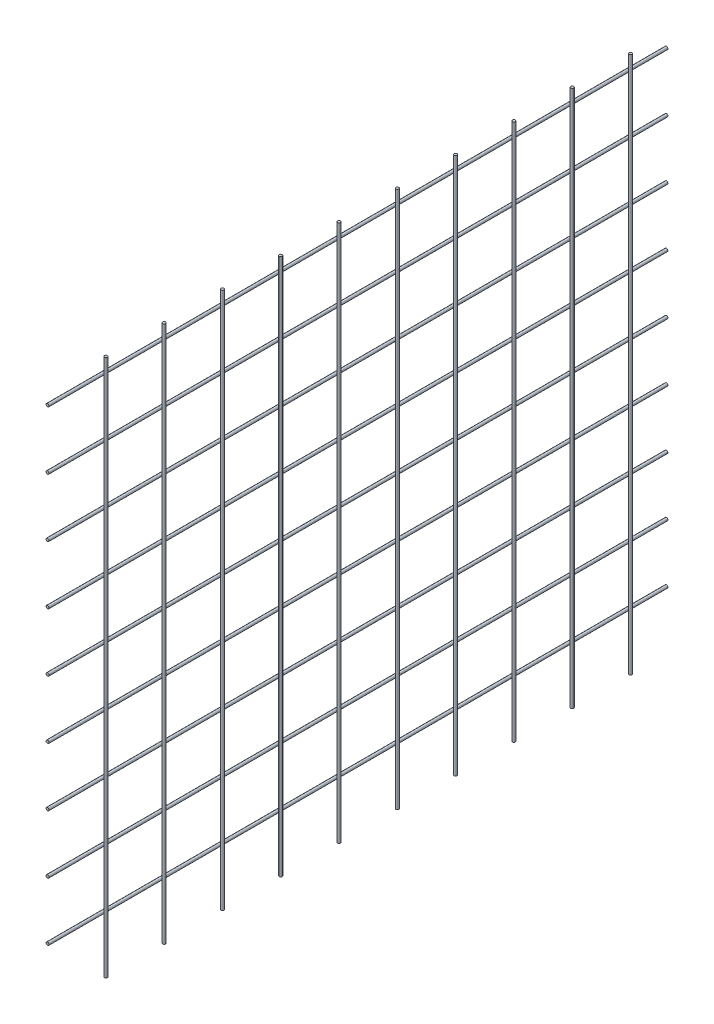
ISO-10303-21;
HEADER;
FILE_DESCRIPTION(('STEP AP214'),'2;1');
FILE_NAME('part.step','',(''),(''),'','','');
FILE_SCHEMA(('AUTOMOTIVE_DESIGN { 1 0 10303 214 1 1 1 1 }'));
ENDSEC;
DATA;
#1=APPLICATION_CONTEXT('core data for automotive mechanical design processes');
#2=APPLICATION_PROTOCOL_DEFINITION('international standard','automotive_design',2000,#1);
#3=PRODUCT_CONTEXT('',#1,'mechanical');
#4=PRODUCT('Part','Part','',(#3));
#5=PRODUCT_RELATED_PRODUCT_CATEGORY('part','',(#4));
#6=PRODUCT_DEFINITION_FORMATION('','',#4);
#7=PRODUCT_DEFINITION_CONTEXT('part definition',#1,'design');
#8=PRODUCT_DEFINITION('design','',#6,#7);
#9=PRODUCT_DEFINITION_SHAPE('','',#8);
#10=(LENGTH_UNIT() NAMED_UNIT(*) SI_UNIT(.MILLI.,.METRE.));
#11=(NAMED_UNIT(*) PLANE_ANGLE_UNIT() SI_UNIT($,.RADIAN.));
#12=(NAMED_UNIT(*) SI_UNIT($,.STERADIAN.) SOLID_ANGLE_UNIT());
#13=UNCERTAINTY_MEASURE_WITH_UNIT(LENGTH_MEASURE(1.E-05),#10,'distance_accuracy_value','');
#14=(GEOMETRIC_REPRESENTATION_CONTEXT(3) GLOBAL_UNCERTAINTY_ASSIGNED_CONTEXT((#13)) GLOBAL_UNIT_ASSIGNED_CONTEXT((#10,
#11,#12)) REPRESENTATION_CONTEXT('',''));
#15=CARTESIAN_POINT('',(0.,0.,0.));
#16=DIRECTION('',(0.,0.,1.));
#17=DIRECTION('',(1.,0.,0.));
#18=AXIS2_PLACEMENT_3D('',#15,#16,#17);
#19=CARTESIAN_POINT('',(0.,760.,-3080.002));
#20=DIRECTION('',(0.,0.,1.));
#21=DIRECTION('',(1.,0.,0.));
#22=AXIS2_PLACEMENT_3D('',#19,#20,#21);
#23=CYLINDRICAL_SURFACE('',#22,1.49999999999986);
#24=CARTESIAN_POINT('',(0.,760.,-3040.));
#25=DIRECTION('',(0.,0.,-1.));
#26=DIRECTION('',(-1.,0.,0.));
#27=AXIS2_PLACEMENT_3D('',#24,#25,#26);
#28=CIRCLE('',#27,1.49999999999986);
#29=CARTESIAN_POINT('',(-1.49999999999985,760.,-3040.));
#30=VERTEX_POINT('',#29);
#31=EDGE_CURVE('E11',#30,#30,#28,.T.);
#32=ORIENTED_EDGE('',*,*,#31,.F.);
#33=EDGE_LOOP('',(#32));
#34=FACE_BOUND('',#33,.T.);
#35=CARTESIAN_POINT('',(0.,760.,-2403.00000000001));
#36=DIRECTION('',(0.,0.,1.));
#37=DIRECTION('',(1.,0.,0.));
#38=AXIS2_PLACEMENT_3D('',#35,#36,#37);
#39=CIRCLE('',#38,1.49999999999986);
#40=CARTESIAN_POINT('',(1.49999999999988,760.,-2403.00000000001));
#41=VERTEX_POINT('',#40);
#42=EDGE_CURVE('E55',#41,#41,#39,.T.);
#43=ORIENTED_EDGE('',*,*,#42,.F.);
#44=EDGE_LOOP('',(#43));
#45=FACE_BOUND('',#44,.T.);
#46=ADVANCED_FACE('F52',(#34,#45),#23,.T.);
#47=CARTESIAN_POINT('',(-15.4999999999997,-2.22044604925031E-13,-3040.));
#48=DIRECTION('',(0.,0.,-1.));
#49=DIRECTION('',(-1.,0.,0.));
#50=AXIS2_PLACEMENT_3D('',#47,#48,#49);
#51=PLANE('',#50);
#52=ORIENTED_EDGE('',*,*,#31,.T.);
#53=EDGE_LOOP('',(#52));
#54=FACE_BOUND('',#53,.T.);
#55=ADVANCED_FACE('F71',(#54),#51,.T.);
#56=CARTESIAN_POINT('',(-20.01,1256.5,-2403.));
#57=DIRECTION('',(0.,0.,1.));
#58=DIRECTION('',(1.,0.,0.));
#59=AXIS2_PLACEMENT_3D('',#56,#57,#58);
#60=PLANE('',#59);
#61=ORIENTED_EDGE('',*,*,#42,.T.);
#62=EDGE_LOOP('',(#61));
#63=FACE_BOUND('',#62,.T.);
#64=ADVANCED_FACE('F68',(#63),#60,.T.);
#65=CLOSED_SHELL('',(#46,#55,#64));
#66=MANIFOLD_SOLID_BREP('B2',#65);
#67=CARTESIAN_POINT('',(0.,820.,-3080.002));
#68=DIRECTION('',(0.,0.,1.));
#69=DIRECTION('',(1.,0.,0.));
#70=AXIS2_PLACEMENT_3D('',#67,#68,#69);
#71=CYLINDRICAL_SURFACE('',#70,1.49999999999986);
#72=CARTESIAN_POINT('',(0.,820.,-3040.));
#73=DIRECTION('',(0.,0.,-1.));
#74=DIRECTION('',(-1.,0.,0.));
#75=AXIS2_PLACEMENT_3D('',#72,#73,#74);
#76=CIRCLE('',#75,1.49999999999986);
#77=CARTESIAN_POINT('',(-1.49999999999985,820.,-3040.));
#78=VERTEX_POINT('',#77);
#79=EDGE_CURVE('E51',#78,#78,#76,.T.);
#80=ORIENTED_EDGE('',*,*,#79,.F.);
#81=EDGE_LOOP('',(#80));
#82=FACE_BOUND('',#81,.T.);
#83=CARTESIAN_POINT('',(0.,820.,-2403.00000000001));
#84=DIRECTION('',(0.,0.,1.));
#85=DIRECTION('',(1.,0.,0.));
#86=AXIS2_PLACEMENT_3D('',#83,#84,#85);
#87=CIRCLE('',#86,1.49999999999986);
#88=CARTESIAN_POINT('',(1.49999999999988,820.,-2403.00000000001));
#89=VERTEX_POINT('',#88);
#90=EDGE_CURVE('E102',#89,#89,#87,.T.);
#91=ORIENTED_EDGE('',*,*,#90,.F.);
#92=EDGE_LOOP('',(#91));
#93=FACE_BOUND('',#92,.T.);
#94=ADVANCED_FACE('F99',(#82,#93),#71,.T.);
#95=CARTESIAN_POINT('',(-15.4999999999997,-2.22044604925031E-13,-3040.));
#96=DIRECTION('',(0.,0.,-1.));
#97=DIRECTION('',(-1.,0.,0.));
#98=AXIS2_PLACEMENT_3D('',#95,#96,#97);
#99=PLANE('',#98);
#100=ORIENTED_EDGE('',*,*,#79,.T.);
#101=EDGE_LOOP('',(#100));
#102=FACE_BOUND('',#101,.T.);
#103=ADVANCED_FACE('F118',(#102),#99,.T.);
#104=CARTESIAN_POINT('',(-20.01,1256.5,-2403.));
#105=DIRECTION('',(0.,0.,1.));
#106=DIRECTION('',(1.,0.,0.));
#107=AXIS2_PLACEMENT_3D('',#104,#105,#106);
#108=PLANE('',#107);
#109=ORIENTED_EDGE('',*,*,#90,.T.);
#110=EDGE_LOOP('',(#109));
#111=FACE_BOUND('',#110,.T.);
#112=ADVANCED_FACE('F115',(#111),#108,.T.);
#113=CLOSED_SHELL('',(#94,#103,#112));
#114=MANIFOLD_SOLID_BREP('B6',#113);
#115=CARTESIAN_POINT('',(0.,880.,-3080.002));
#116=DIRECTION('',(0.,0.,1.));
#117=DIRECTION('',(1.,0.,0.));
#118=AXIS2_PLACEMENT_3D('',#115,#116,#117);
#119=CYLINDRICAL_SURFACE('',#118,1.49999999999986);
#120=CARTESIAN_POINT('',(0.,880.,-3040.));
#121=DIRECTION('',(0.,0.,-1.));
#122=DIRECTION('',(-1.,0.,0.));
#123=AXIS2_PLACEMENT_3D('',#120,#121,#122);
#124=CIRCLE('',#123,1.49999999999986);
#125=CARTESIAN_POINT('',(-1.49999999999985,880.,-3040.));
#126=VERTEX_POINT('',#125);
#127=EDGE_CURVE('E98',#126,#126,#124,.T.);
#128=ORIENTED_EDGE('',*,*,#127,.F.);
#129=EDGE_LOOP('',(#128));
#130=FACE_BOUND('',#129,.T.);
#131=CARTESIAN_POINT('',(0.,880.,-2403.00000000001));
#132=DIRECTION('',(0.,0.,1.));
#133=DIRECTION('',(1.,0.,0.));
#134=AXIS2_PLACEMENT_3D('',#131,#132,#133);
#135=CIRCLE('',#134,1.49999999999986);
#136=CARTESIAN_POINT('',(1.49999999999988,880.,-2403.00000000001));
#137=VERTEX_POINT('',#136);
#138=EDGE_CURVE('E149',#137,#137,#135,.T.);
#139=ORIENTED_EDGE('',*,*,#138,.F.);
#140=EDGE_LOOP('',(#139));
#141=FACE_BOUND('',#140,.T.);
#142=ADVANCED_FACE('F146',(#130,#141),#119,.T.);
#143=CARTESIAN_POINT('',(-15.4999999999997,-2.22044604925031E-13,-3040.));
#144=DIRECTION('',(0.,0.,-1.));
#145=DIRECTION('',(-1.,0.,0.));
#146=AXIS2_PLACEMENT_3D('',#143,#144,#145);
#147=PLANE('',#146);
#148=ORIENTED_EDGE('',*,*,#127,.T.);
#149=EDGE_LOOP('',(#148));
#150=FACE_BOUND('',#149,.T.);
#151=ADVANCED_FACE('F166',(#150),#147,.T.);
#152=CARTESIAN_POINT('',(-20.01,1256.5,-2403.));
#153=DIRECTION('',(0.,0.,1.));
#154=DIRECTION('',(1.,0.,0.));
#155=AXIS2_PLACEMENT_3D('',#152,#153,#154);
#156=PLANE('',#155);
#157=ORIENTED_EDGE('',*,*,#138,.T.);
#158=EDGE_LOOP('',(#157));
#159=FACE_BOUND('',#158,.T.);
#160=ADVANCED_FACE('F163',(#159),#156,.T.);
#161=CLOSED_SHELL('',(#142,#151,#160));
#162=MANIFOLD_SOLID_BREP('B46',#161);
#163=CARTESIAN_POINT('',(0.,940.,-3080.002));
#164=DIRECTION('',(0.,0.,1.));
#165=DIRECTION('',(1.,0.,0.));
#166=AXIS2_PLACEMENT_3D('',#163,#164,#165);
#167=CYLINDRICAL_SURFACE('',#166,1.49999999999986);
#168=CARTESIAN_POINT('',(0.,940.,-3040.));
#169=DIRECTION('',(0.,0.,-1.));
#170=DIRECTION('',(-1.,0.,0.));
#171=AXIS2_PLACEMENT_3D('',#168,#169,#170);
#172=CIRCLE('',#171,1.49999999999986);
#173=CARTESIAN_POINT('',(-1.49999999999985,940.,-3040.));
#174=VERTEX_POINT('',#173);
#175=EDGE_CURVE('E145',#174,#174,#172,.T.);
#176=ORIENTED_EDGE('',*,*,#175,.F.);
#177=EDGE_LOOP('',(#176));
#178=FACE_BOUND('',#177,.T.);
#179=CARTESIAN_POINT('',(0.,940.,-2403.00000000001));
#180=DIRECTION('',(0.,0.,1.));
#181=DIRECTION('',(1.,0.,0.));
#182=AXIS2_PLACEMENT_3D('',#179,#180,#181);
#183=CIRCLE('',#182,1.49999999999986);
#184=CARTESIAN_POINT('',(1.49999999999988,940.,-2403.00000000001));
#185=VERTEX_POINT('',#184);
#186=EDGE_CURVE('E197',#185,#185,#183,.T.);
#187=ORIENTED_EDGE('',*,*,#186,.F.);
#188=EDGE_LOOP('',(#187));
#189=FACE_BOUND('',#188,.T.);
#190=ADVANCED_FACE('F194',(#178,#189),#167,.T.);
#191=CARTESIAN_POINT('',(-15.4999999999997,-2.22044604925031E-13,-3040.));
#192=DIRECTION('',(0.,0.,-1.));
#193=DIRECTION('',(-1.,0.,0.));
#194=AXIS2_PLACEMENT_3D('',#191,#192,#193);
#195=PLANE('',#194);
#196=ORIENTED_EDGE('',*,*,#175,.T.);
#197=EDGE_LOOP('',(#196));
#198=FACE_BOUND('',#197,.T.);
#199=ADVANCED_FACE('F214',(#198),#195,.T.);
#200=CARTESIAN_POINT('',(-20.01,1256.5,-2403.));
#201=DIRECTION('',(0.,0.,1.));
#202=DIRECTION('',(1.,0.,0.));
#203=AXIS2_PLACEMENT_3D('',#200,#201,#202);
#204=PLANE('',#203);
#205=ORIENTED_EDGE('',*,*,#186,.T.);
#206=EDGE_LOOP('',(#205));
#207=FACE_BOUND('',#206,.T.);
#208=ADVANCED_FACE('F211',(#207),#204,.T.);
#209=CLOSED_SHELL('',(#190,#199,#208));
#210=MANIFOLD_SOLID_BREP('B93',#209);
#211=CARTESIAN_POINT('',(0.,1000.,-3080.002));
#212=DIRECTION('',(0.,0.,1.));
#213=DIRECTION('',(1.,0.,0.));
#214=AXIS2_PLACEMENT_3D('',#211,#212,#213);
#215=CYLINDRICAL_SURFACE('',#214,1.49999999999986);
#216=CARTESIAN_POINT('',(0.,1000.,-3040.));
#217=DIRECTION('',(0.,0.,-1.));
#218=DIRECTION('',(-1.,0.,0.));
#219=AXIS2_PLACEMENT_3D('',#216,#217,#218);
#220=CIRCLE('',#219,1.49999999999986);
#221=CARTESIAN_POINT('',(-1.49999999999986,1000.,-3040.));
#222=VERTEX_POINT('',#221);
#223=EDGE_CURVE('E193',#222,#222,#220,.T.);
#224=ORIENTED_EDGE('',*,*,#223,.F.);
#225=EDGE_LOOP('',(#224));
#226=FACE_BOUND('',#225,.T.);
#227=CARTESIAN_POINT('',(0.,1000.,-2403.00000000001));
#228=DIRECTION('',(0.,0.,1.));
#229=DIRECTION('',(1.,0.,0.));
#230=AXIS2_PLACEMENT_3D('',#227,#228,#229);
#231=CIRCLE('',#230,1.49999999999986);
#232=CARTESIAN_POINT('',(1.49999999999986,1000.,-2403.00000000001));
#233=VERTEX_POINT('',#232);
#234=EDGE_CURVE('E245',#233,#233,#231,.T.);
#235=ORIENTED_EDGE('',*,*,#234,.F.);
#236=EDGE_LOOP('',(#235));
#237=FACE_BOUND('',#236,.T.);
#238=ADVANCED_FACE('F242',(#226,#237),#215,.T.);
#239=CARTESIAN_POINT('',(-15.4999999999997,-2.22044604925031E-13,-3040.));
#240=DIRECTION('',(0.,0.,-1.));
#241=DIRECTION('',(-1.,0.,0.));
#242=AXIS2_PLACEMENT_3D('',#239,#240,#241);
#243=PLANE('',#242);
#244=ORIENTED_EDGE('',*,*,#223,.T.);
#245=EDGE_LOOP('',(#244));
#246=FACE_BOUND('',#245,.T.);
#247=ADVANCED_FACE('F262',(#246),#243,.T.);
#248=CARTESIAN_POINT('',(-20.01,1256.5,-2403.));
#249=DIRECTION('',(0.,0.,1.));
#250=DIRECTION('',(1.,0.,0.));
#251=AXIS2_PLACEMENT_3D('',#248,#249,#250);
#252=PLANE('',#251);
#253=ORIENTED_EDGE('',*,*,#234,.T.);
#254=EDGE_LOOP('',(#253));
#255=FACE_BOUND('',#254,.T.);
#256=ADVANCED_FACE('F259',(#255),#252,.T.);
#257=CLOSED_SHELL('',(#238,#247,#256));
#258=MANIFOLD_SOLID_BREP('B140',#257);
#259=CARTESIAN_POINT('',(0.,1060.,-3080.002));
#260=DIRECTION('',(0.,0.,1.));
#261=DIRECTION('',(1.,0.,0.));
#262=AXIS2_PLACEMENT_3D('',#259,#260,#261);
#263=CYLINDRICAL_SURFACE('',#262,1.49999999999986);
#264=CARTESIAN_POINT('',(-5.32907051820075E-12,1060.00000000001,-3040.));
#265=DIRECTION('',(0.,0.,-1.));
#266=DIRECTION('',(-1.,0.,0.));
#267=AXIS2_PLACEMENT_3D('',#264,#265,#266);
#268=CIRCLE('',#267,1.49999999999986);
#269=CARTESIAN_POINT('',(-1.50000000000519,1060.00000000001,-3040.));
#270=VERTEX_POINT('',#269);
#271=EDGE_CURVE('E241',#270,#270,#268,.T.);
#272=ORIENTED_EDGE('',*,*,#271,.F.);
#273=EDGE_LOOP('',(#272));
#274=FACE_BOUND('',#273,.T.);
#275=CARTESIAN_POINT('',(-5.32907051820075E-12,1060.,-2403.00000000001));
#276=DIRECTION('',(0.,0.,1.));
#277=DIRECTION('',(1.,0.,0.));
#278=AXIS2_PLACEMENT_3D('',#275,#276,#277);
#279=CIRCLE('',#278,1.49999999999986);
#280=CARTESIAN_POINT('',(1.49999999999454,1060.,-2403.00000000001));
#281=VERTEX_POINT('',#280);
#282=EDGE_CURVE('E293',#281,#281,#279,.T.);
#283=ORIENTED_EDGE('',*,*,#282,.F.);
#284=EDGE_LOOP('',(#283));
#285=FACE_BOUND('',#284,.T.);
#286=ADVANCED_FACE('F290',(#274,#285),#263,.T.);
#287=CARTESIAN_POINT('',(-15.4999999999997,-2.22044604925031E-13,-3040.));
#288=DIRECTION('',(0.,0.,-1.));
#289=DIRECTION('',(-1.,0.,0.));
#290=AXIS2_PLACEMENT_3D('',#287,#288,#289);
#291=PLANE('',#290);
#292=ORIENTED_EDGE('',*,*,#271,.T.);
#293=EDGE_LOOP('',(#292));
#294=FACE_BOUND('',#293,.T.);
#295=ADVANCED_FACE('F310',(#294),#291,.T.);
#296=CARTESIAN_POINT('',(-20.01,1256.5,-2403.));
#297=DIRECTION('',(0.,0.,1.));
#298=DIRECTION('',(1.,0.,0.));
#299=AXIS2_PLACEMENT_3D('',#296,#297,#298);
#300=PLANE('',#299);
#301=ORIENTED_EDGE('',*,*,#282,.T.);
#302=EDGE_LOOP('',(#301));
#303=FACE_BOUND('',#302,.T.);
#304=ADVANCED_FACE('F307',(#303),#300,.T.);
#305=CLOSED_SHELL('',(#286,#295,#304));
#306=MANIFOLD_SOLID_BREP('B188',#305);
#307=CARTESIAN_POINT('',(0.,1120.,-3080.002));
#308=DIRECTION('',(0.,0.,1.));
#309=DIRECTION('',(1.,0.,0.));
#310=AXIS2_PLACEMENT_3D('',#307,#308,#309);
#311=CYLINDRICAL_SURFACE('',#310,1.49999999999986);
#312=CARTESIAN_POINT('',(0.,1120.,-3040.));
#313=DIRECTION('',(0.,0.,-1.));
#314=DIRECTION('',(-1.,0.,0.));
#315=AXIS2_PLACEMENT_3D('',#312,#313,#314);
#316=CIRCLE('',#315,1.49999999999986);
#317=CARTESIAN_POINT('',(-1.49999999999986,1120.,-3040.));
#318=VERTEX_POINT('',#317);
#319=EDGE_CURVE('E289',#318,#318,#316,.T.);
#320=ORIENTED_EDGE('',*,*,#319,.F.);
#321=EDGE_LOOP('',(#320));
#322=FACE_BOUND('',#321,.T.);
#323=CARTESIAN_POINT('',(0.,1120.,-2403.00000000001));
#324=DIRECTION('',(0.,0.,1.));
#325=DIRECTION('',(1.,0.,0.));
#326=AXIS2_PLACEMENT_3D('',#323,#324,#325);
#327=CIRCLE('',#326,1.49999999999986);
#328=CARTESIAN_POINT('',(1.49999999999986,1120.,-2403.00000000001));
#329=VERTEX_POINT('',#328);
#330=EDGE_CURVE('E341',#329,#329,#327,.T.);
#331=ORIENTED_EDGE('',*,*,#330,.F.);
#332=EDGE_LOOP('',(#331));
#333=FACE_BOUND('',#332,.T.);
#334=ADVANCED_FACE('F338',(#322,#333),#311,.T.);
#335=CARTESIAN_POINT('',(-15.4999999999997,-2.22044604925031E-13,-3040.));
#336=DIRECTION('',(0.,0.,-1.));
#337=DIRECTION('',(-1.,0.,0.));
#338=AXIS2_PLACEMENT_3D('',#335,#336,#337);
#339=PLANE('',#338);
#340=ORIENTED_EDGE('',*,*,#319,.T.);
#341=EDGE_LOOP('',(#340));
#342=FACE_BOUND('',#341,.T.);
#343=ADVANCED_FACE('F358',(#342),#339,.T.);
#344=CARTESIAN_POINT('',(-20.01,1256.5,-2403.));
#345=DIRECTION('',(0.,0.,1.));
#346=DIRECTION('',(1.,0.,0.));
#347=AXIS2_PLACEMENT_3D('',#344,#345,#346);
#348=PLANE('',#347);
#349=ORIENTED_EDGE('',*,*,#330,.T.);
#350=EDGE_LOOP('',(#349));
#351=FACE_BOUND('',#350,.T.);
#352=ADVANCED_FACE('F355',(#351),#348,.T.);
#353=CLOSED_SHELL('',(#334,#343,#352));
#354=MANIFOLD_SOLID_BREP('B236',#353);
#355=CARTESIAN_POINT('',(0.,1180.,-3080.002));
#356=DIRECTION('',(0.,0.,1.));
#357=DIRECTION('',(1.,0.,0.));
#358=AXIS2_PLACEMENT_3D('',#355,#356,#357);
#359=CYLINDRICAL_SURFACE('',#358,1.49999999999986);
#360=CARTESIAN_POINT('',(-5.32907051820075E-12,1180.,-3040.));
#361=DIRECTION('',(0.,0.,-1.));
#362=DIRECTION('',(-1.,0.,0.));
#363=AXIS2_PLACEMENT_3D('',#360,#361,#362);
#364=CIRCLE('',#363,1.49999999999986);
#365=CARTESIAN_POINT('',(-1.50000000000519,1180.,-3040.));
#366=VERTEX_POINT('',#365);
#367=EDGE_CURVE('E337',#366,#366,#364,.T.);
#368=ORIENTED_EDGE('',*,*,#367,.F.);
#369=EDGE_LOOP('',(#368));
#370=FACE_BOUND('',#369,.T.);
#371=CARTESIAN_POINT('',(-5.32907051820075E-12,1180.,-2403.00000000001));
#372=DIRECTION('',(0.,0.,1.));
#373=DIRECTION('',(1.,0.,0.));
#374=AXIS2_PLACEMENT_3D('',#371,#372,#373);
#375=CIRCLE('',#374,1.49999999999986);
#376=CARTESIAN_POINT('',(1.49999999999454,1180.,-2403.00000000001));
#377=VERTEX_POINT('',#376);
#378=EDGE_CURVE('E389',#377,#377,#375,.T.);
#379=ORIENTED_EDGE('',*,*,#378,.F.);
#380=EDGE_LOOP('',(#379));
#381=FACE_BOUND('',#380,.T.);
#382=ADVANCED_FACE('F386',(#370,#381),#359,.T.);
#383=CARTESIAN_POINT('',(-15.4999999999997,-2.22044604925031E-13,-3040.));
#384=DIRECTION('',(0.,0.,-1.));
#385=DIRECTION('',(-1.,0.,0.));
#386=AXIS2_PLACEMENT_3D('',#383,#384,#385);
#387=PLANE('',#386);
#388=ORIENTED_EDGE('',*,*,#367,.T.);
#389=EDGE_LOOP('',(#388));
#390=FACE_BOUND('',#389,.T.);
#391=ADVANCED_FACE('F406',(#390),#387,.T.);
#392=CARTESIAN_POINT('',(-20.01,1256.5,-2403.));
#393=DIRECTION('',(0.,0.,1.));
#394=DIRECTION('',(1.,0.,0.));
#395=AXIS2_PLACEMENT_3D('',#392,#393,#394);
#396=PLANE('',#395);
#397=ORIENTED_EDGE('',*,*,#378,.T.);
#398=EDGE_LOOP('',(#397));
#399=FACE_BOUND('',#398,.T.);
#400=ADVANCED_FACE('F403',(#399),#396,.T.);
#401=CLOSED_SHELL('',(#382,#391,#400));
#402=MANIFOLD_SOLID_BREP('B284',#401);
#403=CARTESIAN_POINT('',(0.,1240.,-3080.002));
#404=DIRECTION('',(0.,0.,1.));
#405=DIRECTION('',(1.,0.,0.));
#406=AXIS2_PLACEMENT_3D('',#403,#404,#405);
#407=CYLINDRICAL_SURFACE('',#406,1.49999999999986);
#408=CARTESIAN_POINT('',(0.,1240.,-3040.));
#409=DIRECTION('',(0.,0.,-1.));
#410=DIRECTION('',(-1.,0.,0.));
#411=AXIS2_PLACEMENT_3D('',#408,#409,#410);
#412=CIRCLE('',#411,1.49999999999986);
#413=CARTESIAN_POINT('',(-1.49999999999986,1240.,-3040.));
#414=VERTEX_POINT('',#413);
#415=EDGE_CURVE('E385',#414,#414,#412,.T.);
#416=ORIENTED_EDGE('',*,*,#415,.F.);
#417=EDGE_LOOP('',(#416));
#418=FACE_BOUND('',#417,.T.);
#419=CARTESIAN_POINT('',(0.,1240.,-2403.));
#420=DIRECTION('',(0.,0.,1.));
#421=DIRECTION('',(1.,0.,0.));
#422=AXIS2_PLACEMENT_3D('',#419,#420,#421);
#423=CIRCLE('',#422,1.49999999999986);
#424=CARTESIAN_POINT('',(1.49999999999986,1240.,-2403.));
#425=VERTEX_POINT('',#424);
#426=EDGE_CURVE('E437',#425,#425,#423,.T.);
#427=ORIENTED_EDGE('',*,*,#426,.F.);
#428=EDGE_LOOP('',(#427));
#429=FACE_BOUND('',#428,.T.);
#430=ADVANCED_FACE('F434',(#418,#429),#407,.T.);
#431=CARTESIAN_POINT('',(-15.4999999999997,-2.22044604925031E-13,-3040.));
#432=DIRECTION('',(0.,0.,-1.));
#433=DIRECTION('',(-1.,0.,0.));
#434=AXIS2_PLACEMENT_3D('',#431,#432,#433);
#435=PLANE('',#434);
#436=ORIENTED_EDGE('',*,*,#415,.T.);
#437=EDGE_LOOP('',(#436));
#438=FACE_BOUND('',#437,.T.);
#439=ADVANCED_FACE('F454',(#438),#435,.T.);
#440=CARTESIAN_POINT('',(-20.01,1256.5,-2403.));
#441=DIRECTION('',(0.,0.,1.));
#442=DIRECTION('',(1.,0.,0.));
#443=AXIS2_PLACEMENT_3D('',#440,#441,#442);
#444=PLANE('',#443);
#445=ORIENTED_EDGE('',*,*,#426,.T.);
#446=EDGE_LOOP('',(#445));
#447=FACE_BOUND('',#446,.T.);
#448=ADVANCED_FACE('F451',(#447),#444,.T.);
#449=CLOSED_SHELL('',(#430,#439,#448));
#450=MANIFOLD_SOLID_BREP('B332',#449);
#451=CARTESIAN_POINT('',(3.00000000000013,1980.002,-3000.));
#452=DIRECTION('',(0.,-1.,0.));
#453=DIRECTION('',(0.,0.,-1.));
#454=AXIS2_PLACEMENT_3D('',#451,#452,#453);
#455=CYLINDRICAL_SURFACE('',#454,1.5);
#456=CARTESIAN_POINT('',(3.000000000005,1256.5,-3000.));
#457=DIRECTION('',(0.,1.,0.));
#458=DIRECTION('',(0.,0.,1.));
#459=AXIS2_PLACEMENT_3D('',#456,#457,#458);
#460=CIRCLE('',#459,1.5);
#461=CARTESIAN_POINT('',(3.000000000005,1256.5,-2998.5));
#462=VERTEX_POINT('',#461);
#463=EDGE_CURVE('E489',#462,#462,#460,.T.);
#464=ORIENTED_EDGE('',*,*,#463,.F.);
#465=EDGE_LOOP('',(#464));
#466=FACE_BOUND('',#465,.T.);
#467=CARTESIAN_POINT('',(3.00000000000013,703.5,-3000.));
#468=DIRECTION('',(0.,-1.,0.));
#469=DIRECTION('',(0.,0.,-1.));
#470=AXIS2_PLACEMENT_3D('',#467,#468,#469);
#471=CIRCLE('',#470,1.5);
#472=CARTESIAN_POINT('',(3.00000000000013,703.5,-3001.5));
#473=VERTEX_POINT('',#472);
#474=EDGE_CURVE('E433',#473,#473,#471,.T.);
#475=ORIENTED_EDGE('',*,*,#474,.F.);
#476=EDGE_LOOP('',(#475));
#477=FACE_BOUND('',#476,.T.);
#478=ADVANCED_FACE('F482',(#466,#477),#455,.T.);
#479=CARTESIAN_POINT('',(-20.01,1256.5,-2403.));
#480=DIRECTION('',(0.,1.,0.));
#481=DIRECTION('',(0.,0.,1.));
#482=AXIS2_PLACEMENT_3D('',#479,#480,#481);
#483=PLANE('',#482);
#484=ORIENTED_EDGE('',*,*,#463,.T.);
#485=EDGE_LOOP('',(#484));
#486=FACE_BOUND('',#485,.T.);
#487=ADVANCED_FACE('F499',(#486),#483,.T.);
#488=CARTESIAN_POINT('',(-20.0100000000001,703.500000000003,-2403.));
#489=DIRECTION('',(0.,-1.,0.));
#490=DIRECTION('',(0.,0.,-1.));
#491=AXIS2_PLACEMENT_3D('',#488,#489,#490);
#492=PLANE('',#491);
#493=ORIENTED_EDGE('',*,*,#474,.T.);
#494=EDGE_LOOP('',(#493));
#495=FACE_BOUND('',#494,.T.);
#496=ADVANCED_FACE('F503',(#495),#492,.T.);
#497=CLOSED_SHELL('',(#478,#487,#496));
#498=MANIFOLD_SOLID_BREP('B380',#497);
#499=CARTESIAN_POINT('',(3.00000000000013,1980.002,-2940.));
#500=DIRECTION('',(0.,-1.,0.));
#501=DIRECTION('',(0.,0.,-1.));
#502=AXIS2_PLACEMENT_3D('',#499,#500,#501);
#503=CYLINDRICAL_SURFACE('',#502,1.5);
#504=CARTESIAN_POINT('',(3.000000000005,1256.5,-2940.));
#505=DIRECTION('',(0.,1.,0.));
#506=DIRECTION('',(0.,0.,1.));
#507=AXIS2_PLACEMENT_3D('',#504,#505,#506);
#508=CIRCLE('',#507,1.5);
#509=CARTESIAN_POINT('',(3.000000000005,1256.5,-2938.5));
#510=VERTEX_POINT('',#509);
#511=EDGE_CURVE('E537',#510,#510,#508,.T.);
#512=ORIENTED_EDGE('',*,*,#511,.F.);
#513=EDGE_LOOP('',(#512));
#514=FACE_BOUND('',#513,.T.);
#515=CARTESIAN_POINT('',(3.00000000000013,703.5,-2940.));
#516=DIRECTION('',(0.,-1.,0.));
#517=DIRECTION('',(0.,0.,-1.));
#518=AXIS2_PLACEMENT_3D('',#515,#516,#517);
#519=CIRCLE('',#518,1.5);
#520=CARTESIAN_POINT('',(3.00000000000013,703.5,-2941.5));
#521=VERTEX_POINT('',#520);
#522=EDGE_CURVE('E481',#521,#521,#519,.T.);
#523=ORIENTED_EDGE('',*,*,#522,.F.);
#524=EDGE_LOOP('',(#523));
#525=FACE_BOUND('',#524,.T.);
#526=ADVANCED_FACE('F530',(#514,#525),#503,.T.);
#527=CARTESIAN_POINT('',(-20.01,1256.5,-2403.));
#528=DIRECTION('',(0.,1.,0.));
#529=DIRECTION('',(0.,0.,1.));
#530=AXIS2_PLACEMENT_3D('',#527,#528,#529);
#531=PLANE('',#530);
#532=ORIENTED_EDGE('',*,*,#511,.T.);
#533=EDGE_LOOP('',(#532));
#534=FACE_BOUND('',#533,.T.);
#535=ADVANCED_FACE('F547',(#534),#531,.T.);
#536=CARTESIAN_POINT('',(-20.0100000000001,703.500000000003,-2403.));
#537=DIRECTION('',(0.,-1.,0.));
#538=DIRECTION('',(0.,0.,-1.));
#539=AXIS2_PLACEMENT_3D('',#536,#537,#538);
#540=PLANE('',#539);
#541=ORIENTED_EDGE('',*,*,#522,.T.);
#542=EDGE_LOOP('',(#541));
#543=FACE_BOUND('',#542,.T.);
#544=ADVANCED_FACE('F551',(#543),#540,.T.);
#545=CLOSED_SHELL('',(#526,#535,#544));
#546=MANIFOLD_SOLID_BREP('B428',#545);
#547=CARTESIAN_POINT('',(3.00000000000013,1980.002,-2880.));
#548=DIRECTION('',(0.,-1.,0.));
#549=DIRECTION('',(0.,0.,-1.));
#550=AXIS2_PLACEMENT_3D('',#547,#548,#549);
#551=CYLINDRICAL_SURFACE('',#550,1.5);
#552=CARTESIAN_POINT('',(3.000000000005,1256.5,-2880.));
#553=DIRECTION('',(0.,1.,0.));
#554=DIRECTION('',(0.,0.,1.));
#555=AXIS2_PLACEMENT_3D('',#552,#553,#554);
#556=CIRCLE('',#555,1.5);
#557=CARTESIAN_POINT('',(3.000000000005,1256.5,-2878.5));
#558=VERTEX_POINT('',#557);
#559=EDGE_CURVE('E585',#558,#558,#556,.T.);
#560=ORIENTED_EDGE('',*,*,#559,.F.);
#561=EDGE_LOOP('',(#560));
#562=FACE_BOUND('',#561,.T.);
#563=CARTESIAN_POINT('',(3.00000000000013,703.5,-2880.));
#564=DIRECTION('',(0.,-1.,0.));
#565=DIRECTION('',(0.,0.,-1.));
#566=AXIS2_PLACEMENT_3D('',#563,#564,#565);
#567=CIRCLE('',#566,1.5);
#568=CARTESIAN_POINT('',(3.00000000000013,703.5,-2881.5));
#569=VERTEX_POINT('',#568);
#570=EDGE_CURVE('E529',#569,#569,#567,.T.);
#571=ORIENTED_EDGE('',*,*,#570,.F.);
#572=EDGE_LOOP('',(#571));
#573=FACE_BOUND('',#572,.T.);
#574=ADVANCED_FACE('F578',(#562,#573),#551,.T.);
#575=CARTESIAN_POINT('',(-20.01,1256.5,-2403.));
#576=DIRECTION('',(0.,1.,0.));
#577=DIRECTION('',(0.,0.,1.));
#578=AXIS2_PLACEMENT_3D('',#575,#576,#577);
#579=PLANE('',#578);
#580=ORIENTED_EDGE('',*,*,#559,.T.);
#581=EDGE_LOOP('',(#580));
#582=FACE_BOUND('',#581,.T.);
#583=ADVANCED_FACE('F594',(#582),#579,.T.);
#584=CARTESIAN_POINT('',(-20.0100000000001,703.500000000003,-2403.));
#585=DIRECTION('',(0.,-1.,0.));
#586=DIRECTION('',(0.,0.,-1.));
#587=AXIS2_PLACEMENT_3D('',#584,#585,#586);
#588=PLANE('',#587);
#589=ORIENTED_EDGE('',*,*,#570,.T.);
#590=EDGE_LOOP('',(#589));
#591=FACE_BOUND('',#590,.T.);
#592=ADVANCED_FACE('F598',(#591),#588,.T.);
#593=CLOSED_SHELL('',(#574,#583,#592));
#594=MANIFOLD_SOLID_BREP('B476',#593);
#595=CARTESIAN_POINT('',(3.00000000000013,1980.002,-2820.));
#596=DIRECTION('',(0.,-1.,0.));
#597=DIRECTION('',(0.,0.,-1.));
#598=AXIS2_PLACEMENT_3D('',#595,#596,#597);
#599=CYLINDRICAL_SURFACE('',#598,1.5);
#600=CARTESIAN_POINT('',(3.00000000000011,1256.5,-2820.));
#601=DIRECTION('',(0.,1.,0.));
#602=DIRECTION('',(0.,0.,1.));
#603=AXIS2_PLACEMENT_3D('',#600,#601,#602);
#604=CIRCLE('',#603,1.5);
#605=CARTESIAN_POINT('',(3.00000000000011,1256.5,-2818.5));
#606=VERTEX_POINT('',#605);
#607=EDGE_CURVE('E632',#606,#606,#604,.T.);
#608=ORIENTED_EDGE('',*,*,#607,.F.);
#609=EDGE_LOOP('',(#608));
#610=FACE_BOUND('',#609,.T.);
#611=CARTESIAN_POINT('',(3.00000000000013,703.5,-2820.));
#612=DIRECTION('',(0.,-1.,0.));
#613=DIRECTION('',(0.,0.,-1.));
#614=AXIS2_PLACEMENT_3D('',#611,#612,#613);
#615=CIRCLE('',#614,1.5);
#616=CARTESIAN_POINT('',(3.00000000000013,703.5,-2821.5));
#617=VERTEX_POINT('',#616);
#618=EDGE_CURVE('E577',#617,#617,#615,.T.);
#619=ORIENTED_EDGE('',*,*,#618,.F.);
#620=EDGE_LOOP('',(#619));
#621=FACE_BOUND('',#620,.T.);
#622=ADVANCED_FACE('F625',(#610,#621),#599,.T.);
#623=CARTESIAN_POINT('',(-20.01,1256.5,-2403.));
#624=DIRECTION('',(0.,1.,0.));
#625=DIRECTION('',(0.,0.,1.));
#626=AXIS2_PLACEMENT_3D('',#623,#624,#625);
#627=PLANE('',#626);
#628=ORIENTED_EDGE('',*,*,#607,.T.);
#629=EDGE_LOOP('',(#628));
#630=FACE_BOUND('',#629,.T.);
#631=ADVANCED_FACE('F642',(#630),#627,.T.);
#632=CARTESIAN_POINT('',(-20.0100000000001,703.500000000003,-2403.));
#633=DIRECTION('',(0.,-1.,0.));
#634=DIRECTION('',(0.,0.,-1.));
#635=AXIS2_PLACEMENT_3D('',#632,#633,#634);
#636=PLANE('',#635);
#637=ORIENTED_EDGE('',*,*,#618,.T.);
#638=EDGE_LOOP('',(#637));
#639=FACE_BOUND('',#638,.T.);
#640=ADVANCED_FACE('F646',(#639),#636,.T.);
#641=CLOSED_SHELL('',(#622,#631,#640));
#642=MANIFOLD_SOLID_BREP('B524',#641);
#643=CARTESIAN_POINT('',(3.00000000000013,1980.002,-2760.));
#644=DIRECTION('',(0.,-1.,0.));
#645=DIRECTION('',(0.,0.,-1.));
#646=AXIS2_PLACEMENT_3D('',#643,#644,#645);
#647=CYLINDRICAL_SURFACE('',#646,1.5);
#648=CARTESIAN_POINT('',(3.00000000000011,1256.5,-2760.));
#649=DIRECTION('',(0.,1.,0.));
#650=DIRECTION('',(0.,0.,1.));
#651=AXIS2_PLACEMENT_3D('',#648,#649,#650);
#652=CIRCLE('',#651,1.5);
#653=CARTESIAN_POINT('',(3.00000000000011,1256.5,-2758.5));
#654=VERTEX_POINT('',#653);
#655=EDGE_CURVE('E680',#654,#654,#652,.T.);
#656=ORIENTED_EDGE('',*,*,#655,.F.);
#657=EDGE_LOOP('',(#656));
#658=FACE_BOUND('',#657,.T.);
#659=CARTESIAN_POINT('',(3.00000000000013,703.5,-2760.));
#660=DIRECTION('',(0.,-1.,0.));
#661=DIRECTION('',(0.,0.,-1.));
#662=AXIS2_PLACEMENT_3D('',#659,#660,#661);
#663=CIRCLE('',#662,1.5);
#664=CARTESIAN_POINT('',(3.00000000000013,703.5,-2761.5));
#665=VERTEX_POINT('',#664);
#666=EDGE_CURVE('E624',#665,#665,#663,.T.);
#667=ORIENTED_EDGE('',*,*,#666,.F.);
#668=EDGE_LOOP('',(#667));
#669=FACE_BOUND('',#668,.T.);
#670=ADVANCED_FACE('F673',(#658,#669),#647,.T.);
#671=CARTESIAN_POINT('',(-20.01,1256.5,-2403.));
#672=DIRECTION('',(0.,1.,0.));
#673=DIRECTION('',(0.,0.,1.));
#674=AXIS2_PLACEMENT_3D('',#671,#672,#673);
#675=PLANE('',#674);
#676=ORIENTED_EDGE('',*,*,#655,.T.);
#677=EDGE_LOOP('',(#676));
#678=FACE_BOUND('',#677,.T.);
#679=ADVANCED_FACE('F689',(#678),#675,.T.);
#680=CARTESIAN_POINT('',(-20.0100000000001,703.500000000003,-2403.));
#681=DIRECTION('',(0.,-1.,0.));
#682=DIRECTION('',(0.,0.,-1.));
#683=AXIS2_PLACEMENT_3D('',#680,#681,#682);
#684=PLANE('',#683);
#685=ORIENTED_EDGE('',*,*,#666,.T.);
#686=EDGE_LOOP('',(#685));
#687=FACE_BOUND('',#686,.T.);
#688=ADVANCED_FACE('F693',(#687),#684,.T.);
#689=CLOSED_SHELL('',(#670,#679,#688));
#690=MANIFOLD_SOLID_BREP('B572',#689);
#691=CARTESIAN_POINT('',(3.00000000000013,1980.002,-2700.));
#692=DIRECTION('',(0.,-1.,0.));
#693=DIRECTION('',(0.,0.,-1.));
#694=AXIS2_PLACEMENT_3D('',#691,#692,#693);
#695=CYLINDRICAL_SURFACE('',#694,1.5);
#696=CARTESIAN_POINT('',(3.00000000000011,1256.5,-2700.));
#697=DIRECTION('',(0.,1.,0.));
#698=DIRECTION('',(0.,0.,1.));
#699=AXIS2_PLACEMENT_3D('',#696,#697,#698);
#700=CIRCLE('',#699,1.5);
#701=CARTESIAN_POINT('',(3.00000000000011,1256.5,-2698.5));
#702=VERTEX_POINT('',#701);
#703=EDGE_CURVE('E727',#702,#702,#700,.T.);
#704=ORIENTED_EDGE('',*,*,#703,.F.);
#705=EDGE_LOOP('',(#704));
#706=FACE_BOUND('',#705,.T.);
#707=CARTESIAN_POINT('',(3.00000000000013,703.5,-2700.));
#708=DIRECTION('',(0.,-1.,0.));
#709=DIRECTION('',(0.,0.,-1.));
#710=AXIS2_PLACEMENT_3D('',#707,#708,#709);
#711=CIRCLE('',#710,1.5);
#712=CARTESIAN_POINT('',(3.00000000000013,703.5,-2701.5));
#713=VERTEX_POINT('',#712);
#714=EDGE_CURVE('E672',#713,#713,#711,.T.);
#715=ORIENTED_EDGE('',*,*,#714,.F.);
#716=EDGE_LOOP('',(#715));
#717=FACE_BOUND('',#716,.T.);
#718=ADVANCED_FACE('F720',(#706,#717),#695,.T.);
#719=CARTESIAN_POINT('',(-20.01,1256.5,-2403.));
#720=DIRECTION('',(0.,1.,0.));
#721=DIRECTION('',(0.,0.,1.));
#722=AXIS2_PLACEMENT_3D('',#719,#720,#721);
#723=PLANE('',#722);
#724=ORIENTED_EDGE('',*,*,#703,.T.);
#725=EDGE_LOOP('',(#724));
#726=FACE_BOUND('',#725,.T.);
#727=ADVANCED_FACE('F736',(#726),#723,.T.);
#728=CARTESIAN_POINT('',(-20.0100000000001,703.500000000003,-2403.));
#729=DIRECTION('',(0.,-1.,0.));
#730=DIRECTION('',(0.,0.,-1.));
#731=AXIS2_PLACEMENT_3D('',#728,#729,#730);
#732=PLANE('',#731);
#733=ORIENTED_EDGE('',*,*,#714,.T.);
#734=EDGE_LOOP('',(#733));
#735=FACE_BOUND('',#734,.T.);
#736=ADVANCED_FACE('F740',(#735),#732,.T.);
#737=CLOSED_SHELL('',(#718,#727,#736));
#738=MANIFOLD_SOLID_BREP('B619',#737);
#739=CARTESIAN_POINT('',(3.00000000000013,1980.002,-2640.));
#740=DIRECTION('',(0.,-1.,0.));
#741=DIRECTION('',(0.,0.,-1.));
#742=AXIS2_PLACEMENT_3D('',#739,#740,#741);
#743=CYLINDRICAL_SURFACE('',#742,1.5);
#744=CARTESIAN_POINT('',(3.00000000000011,1256.5,-2640.));
#745=DIRECTION('',(0.,1.,0.));
#746=DIRECTION('',(0.,0.,1.));
#747=AXIS2_PLACEMENT_3D('',#744,#745,#746);
#748=CIRCLE('',#747,1.5);
#749=CARTESIAN_POINT('',(3.00000000000011,1256.5,-2638.5));
#750=VERTEX_POINT('',#749);
#751=EDGE_CURVE('E774',#750,#750,#748,.T.);
#752=ORIENTED_EDGE('',*,*,#751,.F.);
#753=EDGE_LOOP('',(#752));
#754=FACE_BOUND('',#753,.T.);
#755=CARTESIAN_POINT('',(3.00000000000013,703.5,-2640.));
#756=DIRECTION('',(0.,-1.,0.));
#757=DIRECTION('',(0.,0.,-1.));
#758=AXIS2_PLACEMENT_3D('',#755,#756,#757);
#759=CIRCLE('',#758,1.5);
#760=CARTESIAN_POINT('',(3.00000000000013,703.5,-2641.5));
#761=VERTEX_POINT('',#760);
#762=EDGE_CURVE('E719',#761,#761,#759,.T.);
#763=ORIENTED_EDGE('',*,*,#762,.F.);
#764=EDGE_LOOP('',(#763));
#765=FACE_BOUND('',#764,.T.);
#766=ADVANCED_FACE('F767',(#754,#765),#743,.T.);
#767=CARTESIAN_POINT('',(-20.01,1256.5,-2403.));
#768=DIRECTION('',(0.,1.,0.));
#769=DIRECTION('',(0.,0.,1.));
#770=AXIS2_PLACEMENT_3D('',#767,#768,#769);
#771=PLANE('',#770);
#772=ORIENTED_EDGE('',*,*,#751,.T.);
#773=EDGE_LOOP('',(#772));
#774=FACE_BOUND('',#773,.T.);
#775=ADVANCED_FACE('F783',(#774),#771,.T.);
#776=CARTESIAN_POINT('',(-20.0100000000001,703.500000000003,-2403.));
#777=DIRECTION('',(0.,-1.,0.));
#778=DIRECTION('',(0.,0.,-1.));
#779=AXIS2_PLACEMENT_3D('',#776,#777,#778);
#780=PLANE('',#779);
#781=ORIENTED_EDGE('',*,*,#762,.T.);
#782=EDGE_LOOP('',(#781));
#783=FACE_BOUND('',#782,.T.);
#784=ADVANCED_FACE('F787',(#783),#780,.T.);
#785=CLOSED_SHELL('',(#766,#775,#784));
#786=MANIFOLD_SOLID_BREP('B667',#785);
#787=CARTESIAN_POINT('',(3.00000000000013,1980.002,-2580.));
#788=DIRECTION('',(0.,-1.,0.));
#789=DIRECTION('',(0.,0.,-1.));
#790=AXIS2_PLACEMENT_3D('',#787,#788,#789);
#791=CYLINDRICAL_SURFACE('',#790,1.5);
#792=CARTESIAN_POINT('',(3.00000000000011,1256.5,-2580.));
#793=DIRECTION('',(0.,1.,0.));
#794=DIRECTION('',(0.,0.,1.));
#795=AXIS2_PLACEMENT_3D('',#792,#793,#794);
#796=CIRCLE('',#795,1.5);
#797=CARTESIAN_POINT('',(3.00000000000011,1256.5,-2578.5));
#798=VERTEX_POINT('',#797);
#799=EDGE_CURVE('E821',#798,#798,#796,.T.);
#800=ORIENTED_EDGE('',*,*,#799,.F.);
#801=EDGE_LOOP('',(#800));
#802=FACE_BOUND('',#801,.T.);
#803=CARTESIAN_POINT('',(3.00000000000013,703.5,-2580.));
#804=DIRECTION('',(0.,-1.,0.));
#805=DIRECTION('',(0.,0.,-1.));
#806=AXIS2_PLACEMENT_3D('',#803,#804,#805);
#807=CIRCLE('',#806,1.5);
#808=CARTESIAN_POINT('',(3.00000000000013,703.5,-2581.5));
#809=VERTEX_POINT('',#808);
#810=EDGE_CURVE('E766',#809,#809,#807,.T.);
#811=ORIENTED_EDGE('',*,*,#810,.F.);
#812=EDGE_LOOP('',(#811));
#813=FACE_BOUND('',#812,.T.);
#814=ADVANCED_FACE('F814',(#802,#813),#791,.T.);
#815=CARTESIAN_POINT('',(-20.01,1256.5,-2403.));
#816=DIRECTION('',(0.,1.,0.));
#817=DIRECTION('',(0.,0.,1.));
#818=AXIS2_PLACEMENT_3D('',#815,#816,#817);
#819=PLANE('',#818);
#820=ORIENTED_EDGE('',*,*,#799,.T.);
#821=EDGE_LOOP('',(#820));
#822=FACE_BOUND('',#821,.T.);
#823=ADVANCED_FACE('F830',(#822),#819,.T.);
#824=CARTESIAN_POINT('',(-20.0100000000001,703.500000000003,-2403.));
#825=DIRECTION('',(0.,-1.,0.));
#826=DIRECTION('',(0.,0.,-1.));
#827=AXIS2_PLACEMENT_3D('',#824,#825,#826);
#828=PLANE('',#827);
#829=ORIENTED_EDGE('',*,*,#810,.T.);
#830=EDGE_LOOP('',(#829));
#831=FACE_BOUND('',#830,.T.);
#832=ADVANCED_FACE('F834',(#831),#828,.T.);
#833=CLOSED_SHELL('',(#814,#823,#832));
#834=MANIFOLD_SOLID_BREP('B714',#833);
#835=CARTESIAN_POINT('',(3.00000000000013,1980.002,-2520.));
#836=DIRECTION('',(0.,-1.,0.));
#837=DIRECTION('',(0.,0.,-1.));
#838=AXIS2_PLACEMENT_3D('',#835,#836,#837);
#839=CYLINDRICAL_SURFACE('',#838,1.5);
#840=CARTESIAN_POINT('',(3.00000000000011,1256.5,-2520.));
#841=DIRECTION('',(0.,1.,0.));
#842=DIRECTION('',(0.,0.,1.));
#843=AXIS2_PLACEMENT_3D('',#840,#841,#842);
#844=CIRCLE('',#843,1.5);
#845=CARTESIAN_POINT('',(3.00000000000011,1256.5,-2518.5));
#846=VERTEX_POINT('',#845);
#847=EDGE_CURVE('E867',#846,#846,#844,.T.);
#848=ORIENTED_EDGE('',*,*,#847,.F.);
#849=EDGE_LOOP('',(#848));
#850=FACE_BOUND('',#849,.T.);
#851=CARTESIAN_POINT('',(3.00000000000013,703.5,-2520.));
#852=DIRECTION('',(0.,-1.,0.));
#853=DIRECTION('',(0.,0.,-1.));
#854=AXIS2_PLACEMENT_3D('',#851,#852,#853);
#855=CIRCLE('',#854,1.5);
#856=CARTESIAN_POINT('',(3.00000000000013,703.5,-2521.5));
#857=VERTEX_POINT('',#856);
#858=EDGE_CURVE('E813',#857,#857,#855,.T.);
#859=ORIENTED_EDGE('',*,*,#858,.F.);
#860=EDGE_LOOP('',(#859));
#861=FACE_BOUND('',#860,.T.);
#862=ADVANCED_FACE('F860',(#850,#861),#839,.T.);
#863=CARTESIAN_POINT('',(-20.01,1256.5,-2403.));
#864=DIRECTION('',(0.,1.,0.));
#865=DIRECTION('',(0.,0.,1.));
#866=AXIS2_PLACEMENT_3D('',#863,#864,#865);
#867=PLANE('',#866);
#868=ORIENTED_EDGE('',*,*,#847,.T.);
#869=EDGE_LOOP('',(#868));
#870=FACE_BOUND('',#869,.T.);
#871=ADVANCED_FACE('F876',(#870),#867,.T.);
#872=CARTESIAN_POINT('',(-20.0100000000001,703.500000000003,-2403.));
#873=DIRECTION('',(0.,-1.,0.));
#874=DIRECTION('',(0.,0.,-1.));
#875=AXIS2_PLACEMENT_3D('',#872,#873,#874);
#876=PLANE('',#875);
#877=ORIENTED_EDGE('',*,*,#858,.T.);
#878=EDGE_LOOP('',(#877));
#879=FACE_BOUND('',#878,.T.);
#880=ADVANCED_FACE('F880',(#879),#876,.T.);
#881=CLOSED_SHELL('',(#862,#871,#880));
#882=MANIFOLD_SOLID_BREP('B761',#881);
#883=CARTESIAN_POINT('',(3.00000000000013,1980.002,-2460.));
#884=DIRECTION('',(0.,-1.,0.));
#885=DIRECTION('',(0.,0.,-1.));
#886=AXIS2_PLACEMENT_3D('',#883,#884,#885);
#887=CYLINDRICAL_SURFACE('',#886,1.5);
#888=CARTESIAN_POINT('',(3.00000000000011,1256.5,-2460.));
#889=DIRECTION('',(0.,1.,0.));
#890=DIRECTION('',(0.,0.,1.));
#891=AXIS2_PLACEMENT_3D('',#888,#889,#890);
#892=CIRCLE('',#891,1.5);
#893=CARTESIAN_POINT('',(3.00000000000011,1256.5,-2458.5));
#894=VERTEX_POINT('',#893);
#895=EDGE_CURVE('E906',#894,#894,#892,.T.);
#896=ORIENTED_EDGE('',*,*,#895,.F.);
#897=EDGE_LOOP('',(#896));
#898=FACE_BOUND('',#897,.T.);
#899=CARTESIAN_POINT('',(3.00000000000013,703.5,-2460.));
#900=DIRECTION('',(0.,-1.,0.));
#901=DIRECTION('',(0.,0.,-1.));
#902=AXIS2_PLACEMENT_3D('',#899,#900,#901);
#903=CIRCLE('',#902,1.5);
#904=CARTESIAN_POINT('',(3.00000000000013,703.5,-2461.5));
#905=VERTEX_POINT('',#904);
#906=EDGE_CURVE('E859',#905,#905,#903,.T.);
#907=ORIENTED_EDGE('',*,*,#906,.F.);
#908=EDGE_LOOP('',(#907));
#909=FACE_BOUND('',#908,.T.);
#910=ADVANCED_FACE('F899',(#898,#909),#887,.T.);
#911=CARTESIAN_POINT('',(-20.01,1256.5,-2403.));
#912=DIRECTION('',(0.,1.,0.));
#913=DIRECTION('',(0.,0.,1.));
#914=AXIS2_PLACEMENT_3D('',#911,#912,#913);
#915=PLANE('',#914);
#916=ORIENTED_EDGE('',*,*,#895,.T.);
#917=EDGE_LOOP('',(#916));
#918=FACE_BOUND('',#917,.T.);
#919=ADVANCED_FACE('F915',(#918),#915,.T.);
#920=CARTESIAN_POINT('',(-20.0100000000001,703.500000000003,-2403.));
#921=DIRECTION('',(0.,-1.,0.));
#922=DIRECTION('',(0.,0.,-1.));
#923=AXIS2_PLACEMENT_3D('',#920,#921,#922);
#924=PLANE('',#923);
#925=ORIENTED_EDGE('',*,*,#906,.T.);
#926=EDGE_LOOP('',(#925));
#927=FACE_BOUND('',#926,.T.);
#928=ADVANCED_FACE('F919',(#927),#924,.T.);
#929=CLOSED_SHELL('',(#910,#919,#928));
#930=MANIFOLD_SOLID_BREP('B808',#929);
#931=ADVANCED_BREP_SHAPE_REPRESENTATION('',(#18,#66,#114,#162,#210,#258,#306,#354,#402,#450,
#498,#546,#594,#642,#690,#738,#786,#834,#882,#930),#14);
#932=SHAPE_DEFINITION_REPRESENTATION(#9,#931);
ENDSEC;
END-ISO-10303-21;
